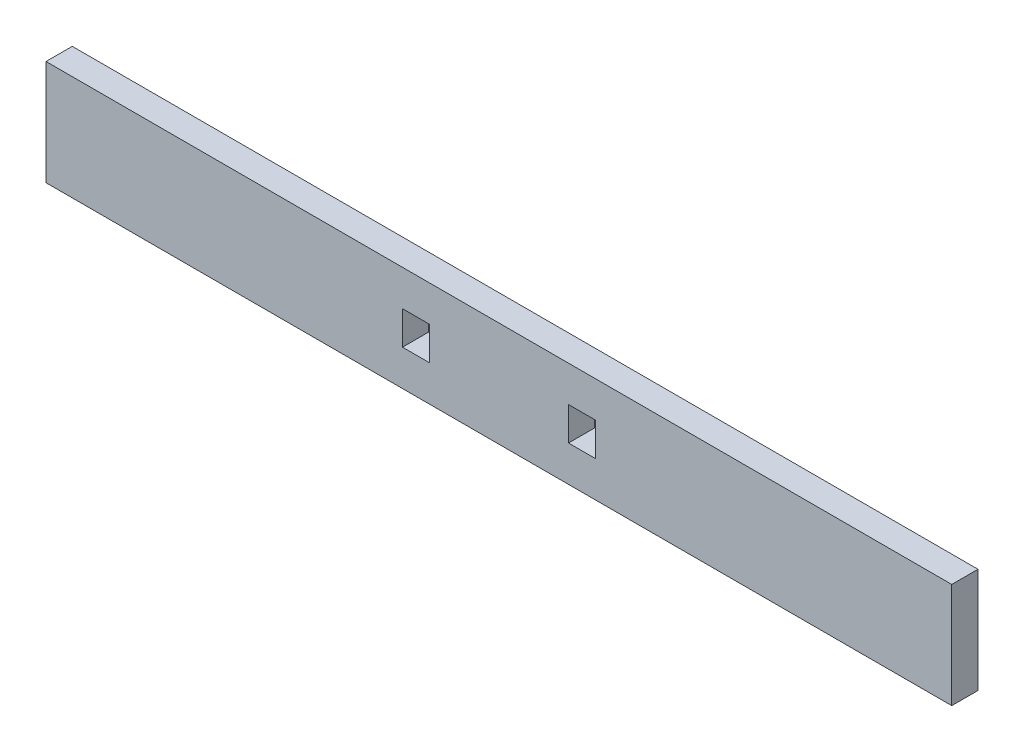
ISO-10303-21;
HEADER;
FILE_DESCRIPTION(('STEP AP214'),'2;1');
FILE_NAME('part.step','',(''),(''),'','','');
FILE_SCHEMA(('AUTOMOTIVE_DESIGN { 1 0 10303 214 1 1 1 1 }'));
ENDSEC;
DATA;
#1=APPLICATION_CONTEXT('core data for automotive mechanical design processes');
#2=APPLICATION_PROTOCOL_DEFINITION('international standard','automotive_design',2000,#1);
#3=PRODUCT_CONTEXT('',#1,'mechanical');
#4=PRODUCT('Part','Part','',(#3));
#5=PRODUCT_RELATED_PRODUCT_CATEGORY('part','',(#4));
#6=PRODUCT_DEFINITION_FORMATION('','',#4);
#7=PRODUCT_DEFINITION_CONTEXT('part definition',#1,'design');
#8=PRODUCT_DEFINITION('design','',#6,#7);
#9=PRODUCT_DEFINITION_SHAPE('','',#8);
#10=(LENGTH_UNIT() NAMED_UNIT(*) SI_UNIT(.MILLI.,.METRE.));
#11=(NAMED_UNIT(*) PLANE_ANGLE_UNIT() SI_UNIT($,.RADIAN.));
#12=(NAMED_UNIT(*) SI_UNIT($,.STERADIAN.) SOLID_ANGLE_UNIT());
#13=UNCERTAINTY_MEASURE_WITH_UNIT(LENGTH_MEASURE(1.E-05),#10,'distance_accuracy_value','');
#14=(GEOMETRIC_REPRESENTATION_CONTEXT(3) GLOBAL_UNCERTAINTY_ASSIGNED_CONTEXT((#13)) GLOBAL_UNIT_ASSIGNED_CONTEXT((#10,
#11,#12)) REPRESENTATION_CONTEXT('',''));
#15=CARTESIAN_POINT('',(0.,0.,0.));
#16=DIRECTION('',(0.,0.,1.));
#17=DIRECTION('',(1.,0.,0.));
#18=AXIS2_PLACEMENT_3D('',#15,#16,#17);
#19=CARTESIAN_POINT('',(-33.672999964,-15.0495,-19.05));
#20=DIRECTION('',(1.,0.,0.));
#21=DIRECTION('',(0.,0.,-1.));
#22=AXIS2_PLACEMENT_3D('',#19,#20,#21);
#23=PLANE('',#22);
#24=DIRECTION('',(0.,1.,0.));
#25=VECTOR('',#24,1.);
#26=CARTESIAN_POINT('',(-33.672999964,-15.0495,-31.75));
#27=LINE('',#26,#25);
#28=CARTESIAN_POINT('',(-33.672999964,-15.0495,-31.75));
#29=VERTEX_POINT('',#28);
#30=CARTESIAN_POINT('',(-33.672999964,1.0795,-31.75));
#31=VERTEX_POINT('',#30);
#32=EDGE_CURVE('E209',#29,#31,#27,.T.);
#33=ORIENTED_EDGE('',*,*,#32,.F.);
#34=DIRECTION('',(0.,0.,-1.));
#35=VECTOR('',#34,1.);
#36=CARTESIAN_POINT('',(-33.672999964,-15.0495,-19.05));
#37=LINE('',#36,#35);
#38=CARTESIAN_POINT('',(-33.672999964,-15.0495,-19.05));
#39=VERTEX_POINT('',#38);
#40=EDGE_CURVE('E179',#39,#29,#37,.T.);
#41=ORIENTED_EDGE('',*,*,#40,.F.);
#42=DIRECTION('',(0.,1.,0.));
#43=VECTOR('',#42,1.);
#44=CARTESIAN_POINT('',(-33.672999964,-15.0495,-19.05));
#45=LINE('',#44,#43);
#46=CARTESIAN_POINT('',(-33.672999964,1.0795,-19.05));
#47=VERTEX_POINT('',#46);
#48=EDGE_CURVE('E235',#39,#47,#45,.T.);
#49=ORIENTED_EDGE('',*,*,#48,.T.);
#50=DIRECTION('',(0.,0.,-1.));
#51=VECTOR('',#50,1.);
#52=CARTESIAN_POINT('',(-33.672999964,1.0795,-19.05));
#53=LINE('',#52,#51);
#54=EDGE_CURVE('E11',#47,#31,#53,.T.);
#55=ORIENTED_EDGE('',*,*,#54,.T.);
#56=EDGE_LOOP('',(#33,#41,#49,#55));
#57=FACE_BOUND('',#56,.T.);
#58=ADVANCED_FACE('F16',(#57),#23,.F.);
#59=CARTESIAN_POINT('',(-33.672999964,1.0795,-19.05));
#60=DIRECTION('',(0.,1.,0.));
#61=DIRECTION('',(1.,0.,0.));
#62=AXIS2_PLACEMENT_3D('',#59,#60,#61);
#63=PLANE('',#62);
#64=DIRECTION('',(-1.,0.,0.));
#65=VECTOR('',#64,1.);
#66=CARTESIAN_POINT('',(-33.672999964,1.0795,-31.75));
#67=LINE('',#66,#65);
#68=CARTESIAN_POINT('',(-46.626999964,1.0795,-31.75));
#69=VERTEX_POINT('',#68);
#70=EDGE_CURVE('E213',#31,#69,#67,.T.);
#71=ORIENTED_EDGE('',*,*,#70,.F.);
#72=ORIENTED_EDGE('',*,*,#54,.F.);
#73=DIRECTION('',(-1.,0.,0.));
#74=VECTOR('',#73,1.);
#75=CARTESIAN_POINT('',(-33.672999964,1.0795,-19.05));
#76=LINE('',#75,#74);
#77=CARTESIAN_POINT('',(-46.626999964,1.0795,-19.05));
#78=VERTEX_POINT('',#77);
#79=EDGE_CURVE('E20',#47,#78,#76,.T.);
#80=ORIENTED_EDGE('',*,*,#79,.T.);
#81=DIRECTION('',(0.,0.,-1.));
#82=VECTOR('',#81,1.);
#83=CARTESIAN_POINT('',(-46.626999964,1.0795,-19.05));
#84=LINE('',#83,#82);
#85=EDGE_CURVE('E27',#78,#69,#84,.T.);
#86=ORIENTED_EDGE('',*,*,#85,.T.);
#87=EDGE_LOOP('',(#71,#72,#80,#86));
#88=FACE_BOUND('',#87,.T.);
#89=ADVANCED_FACE('F305',(#88),#63,.F.);
#90=CARTESIAN_POINT('',(-46.626999964,1.0795,-19.05));
#91=DIRECTION('',(-1.,0.,0.));
#92=DIRECTION('',(0.,1.,0.));
#93=AXIS2_PLACEMENT_3D('',#90,#91,#92);
#94=PLANE('',#93);
#95=DIRECTION('',(0.,-1.,0.));
#96=VECTOR('',#95,1.);
#97=CARTESIAN_POINT('',(-46.626999964,1.0795,-31.75));
#98=LINE('',#97,#96);
#99=CARTESIAN_POINT('',(-46.626999964,-15.0495,-31.75));
#100=VERTEX_POINT('',#99);
#101=EDGE_CURVE('E217',#69,#100,#98,.T.);
#102=ORIENTED_EDGE('',*,*,#101,.F.);
#103=ORIENTED_EDGE('',*,*,#85,.F.);
#104=DIRECTION('',(0.,-1.,0.));
#105=VECTOR('',#104,1.);
#106=CARTESIAN_POINT('',(-46.626999964,1.0795,-19.05));
#107=LINE('',#106,#105);
#108=CARTESIAN_POINT('',(-46.626999964,-15.0495,-19.05));
#109=VERTEX_POINT('',#108);
#110=EDGE_CURVE('E203',#78,#109,#107,.T.);
#111=ORIENTED_EDGE('',*,*,#110,.T.);
#112=DIRECTION('',(0.,0.,-1.));
#113=VECTOR('',#112,1.);
#114=CARTESIAN_POINT('',(-46.626999964,-15.0495,-19.05));
#115=LINE('',#114,#113);
#116=EDGE_CURVE('E176',#109,#100,#115,.T.);
#117=ORIENTED_EDGE('',*,*,#116,.T.);
#118=EDGE_LOOP('',(#102,#103,#111,#117));
#119=FACE_BOUND('',#118,.T.);
#120=ADVANCED_FACE('F311',(#119),#94,.F.);
#121=CARTESIAN_POINT('',(-46.626999964,-15.0495,-19.05));
#122=DIRECTION('',(0.,-1.,0.));
#123=DIRECTION('',(-1.,0.,0.));
#124=AXIS2_PLACEMENT_3D('',#121,#122,#123);
#125=PLANE('',#124);
#126=DIRECTION('',(1.,0.,0.));
#127=VECTOR('',#126,1.);
#128=CARTESIAN_POINT('',(-46.626999964,-15.0495,-31.75));
#129=LINE('',#128,#127);
#130=EDGE_CURVE('E170',#100,#29,#129,.T.);
#131=ORIENTED_EDGE('',*,*,#130,.F.);
#132=ORIENTED_EDGE('',*,*,#116,.F.);
#133=DIRECTION('',(1.,0.,0.));
#134=VECTOR('',#133,1.);
#135=CARTESIAN_POINT('',(-46.626999964,-15.0495,-19.05));
#136=LINE('',#135,#134);
#137=EDGE_CURVE('E222',#109,#39,#136,.T.);
#138=ORIENTED_EDGE('',*,*,#137,.T.);
#139=ORIENTED_EDGE('',*,*,#40,.T.);
#140=EDGE_LOOP('',(#131,#132,#138,#139));
#141=FACE_BOUND('',#140,.T.);
#142=ADVANCED_FACE('F317',(#141),#125,.F.);
#143=CARTESIAN_POINT('',(-219.075,18.415,-19.05));
#144=DIRECTION('',(-1.,0.,0.));
#145=DIRECTION('',(0.,1.,0.));
#146=AXIS2_PLACEMENT_3D('',#143,#144,#145);
#147=PLANE('',#146);
#148=DIRECTION('',(0.,-1.,0.));
#149=VECTOR('',#148,1.);
#150=CARTESIAN_POINT('',(-219.075,18.415,-31.75));
#151=LINE('',#150,#149);
#152=CARTESIAN_POINT('',(-219.075,18.415,-31.75));
#153=VERTEX_POINT('',#152);
#154=CARTESIAN_POINT('',(-219.075,-32.385,-31.75));
#155=VERTEX_POINT('',#154);
#156=EDGE_CURVE('E200',#153,#155,#151,.T.);
#157=ORIENTED_EDGE('',*,*,#156,.T.);
#158=DIRECTION('',(0.,0.,-1.));
#159=VECTOR('',#158,1.);
#160=CARTESIAN_POINT('',(-219.075,-32.385,-19.05));
#161=LINE('',#160,#159);
#162=CARTESIAN_POINT('',(-219.075,-32.385,-19.05));
#163=VERTEX_POINT('',#162);
#164=EDGE_CURVE('E164',#163,#155,#161,.T.);
#165=ORIENTED_EDGE('',*,*,#164,.F.);
#166=DIRECTION('',(0.,-1.,0.));
#167=VECTOR('',#166,1.);
#168=CARTESIAN_POINT('',(-219.075,18.415,-19.05));
#169=LINE('',#168,#167);
#170=CARTESIAN_POINT('',(-219.075,18.415,-19.05));
#171=VERTEX_POINT('',#170);
#172=EDGE_CURVE('E159',#171,#163,#169,.T.);
#173=ORIENTED_EDGE('',*,*,#172,.F.);
#174=DIRECTION('',(0.,0.,-1.));
#175=VECTOR('',#174,1.);
#176=CARTESIAN_POINT('',(-219.075,18.415,-19.05));
#177=LINE('',#176,#175);
#178=EDGE_CURVE('E207',#171,#153,#177,.T.);
#179=ORIENTED_EDGE('',*,*,#178,.T.);
#180=EDGE_LOOP('',(#157,#165,#173,#179));
#181=FACE_BOUND('',#180,.T.);
#182=ADVANCED_FACE('F289',(#181),#147,.T.);
#183=CARTESIAN_POINT('',(33.672999964,-15.0495,-19.05));
#184=DIRECTION('',(-1.,0.,0.));
#185=DIRECTION('',(0.,0.,1.));
#186=AXIS2_PLACEMENT_3D('',#183,#184,#185);
#187=PLANE('',#186);
#188=DIRECTION('',(0.,1.,0.));
#189=VECTOR('',#188,1.);
#190=CARTESIAN_POINT('',(33.672999964,-15.0495,-31.75));
#191=LINE('',#190,#189);
#192=CARTESIAN_POINT('',(33.672999964,-15.0495,-31.75));
#193=VERTEX_POINT('',#192);
#194=CARTESIAN_POINT('',(33.672999964,1.0795,-31.75));
#195=VERTEX_POINT('',#194);
#196=EDGE_CURVE('E167',#193,#195,#191,.T.);
#197=ORIENTED_EDGE('',*,*,#196,.T.);
#198=DIRECTION('',(0.,0.,-1.));
#199=VECTOR('',#198,1.);
#200=CARTESIAN_POINT('',(33.672999964,1.0795,-19.05));
#201=LINE('',#200,#199);
#202=CARTESIAN_POINT('',(33.672999964,1.0795,-19.05));
#203=VERTEX_POINT('',#202);
#204=EDGE_CURVE('E180',#203,#195,#201,.T.);
#205=ORIENTED_EDGE('',*,*,#204,.F.);
#206=DIRECTION('',(0.,1.,0.));
#207=VECTOR('',#206,1.);
#208=CARTESIAN_POINT('',(33.672999964,-15.0495,-19.05));
#209=LINE('',#208,#207);
#210=CARTESIAN_POINT('',(33.672999964,-15.0495,-19.05));
#211=VERTEX_POINT('',#210);
#212=EDGE_CURVE('E151',#211,#203,#209,.T.);
#213=ORIENTED_EDGE('',*,*,#212,.F.);
#214=DIRECTION('',(0.,0.,-1.));
#215=VECTOR('',#214,1.);
#216=CARTESIAN_POINT('',(33.672999964,-15.0495,-19.05));
#217=LINE('',#216,#215);
#218=EDGE_CURVE('E142',#211,#193,#217,.T.);
#219=ORIENTED_EDGE('',*,*,#218,.T.);
#220=EDGE_LOOP('',(#197,#205,#213,#219));
#221=FACE_BOUND('',#220,.T.);
#222=ADVANCED_FACE('F400',(#221),#187,.F.);
#223=CARTESIAN_POINT('',(33.672999964,1.0795,-19.05));
#224=DIRECTION('',(0.,1.,0.));
#225=DIRECTION('',(1.,0.,0.));
#226=AXIS2_PLACEMENT_3D('',#223,#224,#225);
#227=PLANE('',#226);
#228=DIRECTION('',(1.,0.,0.));
#229=VECTOR('',#228,1.);
#230=CARTESIAN_POINT('',(33.672999964,1.0795,-31.75));
#231=LINE('',#230,#229);
#232=CARTESIAN_POINT('',(46.626999964,1.07949999999999,-31.75));
#233=VERTEX_POINT('',#232);
#234=EDGE_CURVE('E171',#195,#233,#231,.T.);
#235=ORIENTED_EDGE('',*,*,#234,.T.);
#236=DIRECTION('',(0.,0.,-1.));
#237=VECTOR('',#236,1.);
#238=CARTESIAN_POINT('',(46.626999964,1.07949999999999,-19.05));
#239=LINE('',#238,#237);
#240=CARTESIAN_POINT('',(46.626999964,1.07949999999999,-19.05));
#241=VERTEX_POINT('',#240);
#242=EDGE_CURVE('E141',#241,#233,#239,.T.);
#243=ORIENTED_EDGE('',*,*,#242,.F.);
#244=DIRECTION('',(1.,0.,0.));
#245=VECTOR('',#244,1.);
#246=CARTESIAN_POINT('',(33.672999964,1.0795,-19.05));
#247=LINE('',#246,#245);
#248=EDGE_CURVE('E157',#203,#241,#247,.T.);
#249=ORIENTED_EDGE('',*,*,#248,.F.);
#250=ORIENTED_EDGE('',*,*,#204,.T.);
#251=EDGE_LOOP('',(#235,#243,#249,#250));
#252=FACE_BOUND('',#251,.T.);
#253=ADVANCED_FACE('F404',(#252),#227,.F.);
#254=CARTESIAN_POINT('',(46.626999964,1.07949999999999,-19.05));
#255=DIRECTION('',(1.,0.,0.));
#256=DIRECTION('',(0.,1.,0.));
#257=AXIS2_PLACEMENT_3D('',#254,#255,#256);
#258=PLANE('',#257);
#259=DIRECTION('',(0.,-1.,0.));
#260=VECTOR('',#259,1.);
#261=CARTESIAN_POINT('',(46.626999964,1.07949999999999,-31.75));
#262=LINE('',#261,#260);
#263=CARTESIAN_POINT('',(46.626999964,-15.0495,-31.75));
#264=VERTEX_POINT('',#263);
#265=EDGE_CURVE('E136',#233,#264,#262,.T.);
#266=ORIENTED_EDGE('',*,*,#265,.T.);
#267=DIRECTION('',(0.,0.,-1.));
#268=VECTOR('',#267,1.);
#269=CARTESIAN_POINT('',(46.626999964,-15.0495,-19.05));
#270=LINE('',#269,#268);
#271=CARTESIAN_POINT('',(46.626999964,-15.0495,-19.05));
#272=VERTEX_POINT('',#271);
#273=EDGE_CURVE('E130',#272,#264,#270,.T.);
#274=ORIENTED_EDGE('',*,*,#273,.F.);
#275=DIRECTION('',(0.,-1.,0.));
#276=VECTOR('',#275,1.);
#277=CARTESIAN_POINT('',(46.626999964,1.07949999999999,-19.05));
#278=LINE('',#277,#276);
#279=EDGE_CURVE('E134',#241,#272,#278,.T.);
#280=ORIENTED_EDGE('',*,*,#279,.F.);
#281=ORIENTED_EDGE('',*,*,#242,.T.);
#282=EDGE_LOOP('',(#266,#274,#280,#281));
#283=FACE_BOUND('',#282,.T.);
#284=ADVANCED_FACE('F132',(#283),#258,.F.);
#285=CARTESIAN_POINT('',(46.626999964,-15.0495,-19.05));
#286=DIRECTION('',(0.,-1.,0.));
#287=DIRECTION('',(0.,0.,-1.));
#288=AXIS2_PLACEMENT_3D('',#285,#286,#287);
#289=PLANE('',#288);
#290=DIRECTION('',(-1.,0.,0.));
#291=VECTOR('',#290,1.);
#292=CARTESIAN_POINT('',(46.626999964,-15.0495,-31.75));
#293=LINE('',#292,#291);
#294=EDGE_CURVE('E175',#264,#193,#293,.T.);
#295=ORIENTED_EDGE('',*,*,#294,.T.);
#296=ORIENTED_EDGE('',*,*,#218,.F.);
#297=DIRECTION('',(-1.,0.,0.));
#298=VECTOR('',#297,1.);
#299=CARTESIAN_POINT('',(46.626999964,-15.0495,-19.05));
#300=LINE('',#299,#298);
#301=EDGE_CURVE('E145',#272,#211,#300,.T.);
#302=ORIENTED_EDGE('',*,*,#301,.F.);
#303=ORIENTED_EDGE('',*,*,#273,.T.);
#304=EDGE_LOOP('',(#295,#296,#302,#303));
#305=FACE_BOUND('',#304,.T.);
#306=ADVANCED_FACE('F18',(#305),#289,.F.);
#307=CARTESIAN_POINT('',(0.,0.,-31.75));
#308=DIRECTION('',(0.,0.,-1.));
#309=DIRECTION('',(0.,-1.,0.));
#310=AXIS2_PLACEMENT_3D('',#307,#308,#309);
#311=PLANE('',#310);
#312=ORIENTED_EDGE('',*,*,#130,.T.);
#313=ORIENTED_EDGE('',*,*,#32,.T.);
#314=ORIENTED_EDGE('',*,*,#70,.T.);
#315=ORIENTED_EDGE('',*,*,#101,.T.);
#316=EDGE_LOOP('',(#312,#313,#314,#315));
#317=FACE_BOUND('',#316,.T.);
#318=ORIENTED_EDGE('',*,*,#294,.F.);
#319=ORIENTED_EDGE('',*,*,#265,.F.);
#320=ORIENTED_EDGE('',*,*,#234,.F.);
#321=ORIENTED_EDGE('',*,*,#196,.F.);
#322=EDGE_LOOP('',(#318,#319,#320,#321));
#323=FACE_BOUND('',#322,.T.);
#324=DIRECTION('',(0.,-1.,0.));
#325=VECTOR('',#324,1.);
#326=CARTESIAN_POINT('',(219.075,18.415,-31.75));
#327=LINE('',#326,#325);
#328=CARTESIAN_POINT('',(219.075,18.415,-31.75));
#329=VERTEX_POINT('',#328);
#330=CARTESIAN_POINT('',(219.075,-32.385,-31.75));
#331=VERTEX_POINT('',#330);
#332=EDGE_CURVE('E189',#329,#331,#327,.T.);
#333=ORIENTED_EDGE('',*,*,#332,.T.);
#334=DIRECTION('',(-1.,0.,0.));
#335=VECTOR('',#334,1.);
#336=CARTESIAN_POINT('',(219.075,-32.385,-31.75));
#337=LINE('',#336,#335);
#338=EDGE_CURVE('E185',#331,#155,#337,.T.);
#339=ORIENTED_EDGE('',*,*,#338,.T.);
#340=ORIENTED_EDGE('',*,*,#156,.F.);
#341=DIRECTION('',(1.,0.,0.));
#342=VECTOR('',#341,1.);
#343=CARTESIAN_POINT('',(219.075,18.415,-31.75));
#344=LINE('',#343,#342);
#345=EDGE_CURVE('E204',#153,#329,#344,.T.);
#346=ORIENTED_EDGE('',*,*,#345,.T.);
#347=EDGE_LOOP('',(#333,#339,#340,#346));
#348=FACE_BOUND('',#347,.T.);
#349=ADVANCED_FACE('F280',(#317,#323,#348),#311,.T.);
#350=CARTESIAN_POINT('',(0.,0.,-19.05));
#351=DIRECTION('',(0.,0.,-1.));
#352=DIRECTION('',(0.,-1.,0.));
#353=AXIS2_PLACEMENT_3D('',#350,#351,#352);
#354=PLANE('',#353);
#355=ORIENTED_EDGE('',*,*,#110,.F.);
#356=ORIENTED_EDGE('',*,*,#79,.F.);
#357=ORIENTED_EDGE('',*,*,#48,.F.);
#358=ORIENTED_EDGE('',*,*,#137,.F.);
#359=EDGE_LOOP('',(#355,#356,#357,#358));
#360=FACE_BOUND('',#359,.T.);
#361=ORIENTED_EDGE('',*,*,#279,.T.);
#362=ORIENTED_EDGE('',*,*,#301,.T.);
#363=ORIENTED_EDGE('',*,*,#212,.T.);
#364=ORIENTED_EDGE('',*,*,#248,.T.);
#365=EDGE_LOOP('',(#361,#362,#363,#364));
#366=FACE_BOUND('',#365,.T.);
#367=DIRECTION('',(0.,-1.,0.));
#368=VECTOR('',#367,1.);
#369=CARTESIAN_POINT('',(219.075,18.415,-19.05));
#370=LINE('',#369,#368);
#371=CARTESIAN_POINT('',(219.075,18.415,-19.05));
#372=VERTEX_POINT('',#371);
#373=CARTESIAN_POINT('',(219.075,-32.385,-19.05));
#374=VERTEX_POINT('',#373);
#375=EDGE_CURVE('E241',#372,#374,#370,.T.);
#376=ORIENTED_EDGE('',*,*,#375,.F.);
#377=DIRECTION('',(1.,0.,0.));
#378=VECTOR('',#377,1.);
#379=CARTESIAN_POINT('',(219.075,18.415,-19.05));
#380=LINE('',#379,#378);
#381=EDGE_CURVE('E223',#171,#372,#380,.T.);
#382=ORIENTED_EDGE('',*,*,#381,.F.);
#383=ORIENTED_EDGE('',*,*,#172,.T.);
#384=DIRECTION('',(-1.,0.,0.));
#385=VECTOR('',#384,1.);
#386=CARTESIAN_POINT('',(219.075,-32.385,-19.05));
#387=LINE('',#386,#385);
#388=EDGE_CURVE('E181',#374,#163,#387,.T.);
#389=ORIENTED_EDGE('',*,*,#388,.F.);
#390=EDGE_LOOP('',(#376,#382,#383,#389));
#391=FACE_BOUND('',#390,.T.);
#392=ADVANCED_FACE('F154',(#360,#366,#391),#354,.F.);
#393=CARTESIAN_POINT('',(219.075,-32.385,-19.05));
#394=DIRECTION('',(0.,-1.,0.));
#395=DIRECTION('',(0.,0.,-1.));
#396=AXIS2_PLACEMENT_3D('',#393,#394,#395);
#397=PLANE('',#396);
#398=ORIENTED_EDGE('',*,*,#338,.F.);
#399=DIRECTION('',(0.,0.,-1.));
#400=VECTOR('',#399,1.);
#401=CARTESIAN_POINT('',(219.075,-32.385,-19.05));
#402=LINE('',#401,#400);
#403=EDGE_CURVE('E208',#374,#331,#402,.T.);
#404=ORIENTED_EDGE('',*,*,#403,.F.);
#405=ORIENTED_EDGE('',*,*,#388,.T.);
#406=ORIENTED_EDGE('',*,*,#164,.T.);
#407=EDGE_LOOP('',(#398,#404,#405,#406));
#408=FACE_BOUND('',#407,.T.);
#409=ADVANCED_FACE('F286',(#408),#397,.T.);
#410=CARTESIAN_POINT('',(219.075,18.415,-19.05));
#411=DIRECTION('',(0.,1.,0.));
#412=DIRECTION('',(1.,0.,0.));
#413=AXIS2_PLACEMENT_3D('',#410,#411,#412);
#414=PLANE('',#413);
#415=ORIENTED_EDGE('',*,*,#345,.F.);
#416=ORIENTED_EDGE('',*,*,#178,.F.);
#417=ORIENTED_EDGE('',*,*,#381,.T.);
#418=DIRECTION('',(0.,0.,-1.));
#419=VECTOR('',#418,1.);
#420=CARTESIAN_POINT('',(219.075,18.415,-19.05));
#421=LINE('',#420,#419);
#422=EDGE_CURVE('E193',#372,#329,#421,.T.);
#423=ORIENTED_EDGE('',*,*,#422,.T.);
#424=EDGE_LOOP('',(#415,#416,#417,#423));
#425=FACE_BOUND('',#424,.T.);
#426=ADVANCED_FACE('F272',(#425),#414,.T.);
#427=CARTESIAN_POINT('',(219.075,18.415,-19.05));
#428=DIRECTION('',(1.,0.,0.));
#429=DIRECTION('',(0.,1.,0.));
#430=AXIS2_PLACEMENT_3D('',#427,#428,#429);
#431=PLANE('',#430);
#432=ORIENTED_EDGE('',*,*,#332,.F.);
#433=ORIENTED_EDGE('',*,*,#422,.F.);
#434=ORIENTED_EDGE('',*,*,#375,.T.);
#435=ORIENTED_EDGE('',*,*,#403,.T.);
#436=EDGE_LOOP('',(#432,#433,#434,#435));
#437=FACE_BOUND('',#436,.T.);
#438=ADVANCED_FACE('F277',(#437),#431,.T.);
#439=CLOSED_SHELL('',(#58,#89,#120,#142,#182,#222,#253,#284,#306,#349,#392,#409,#426,#438));
#440=MANIFOLD_SOLID_BREP('B1',#439);
#441=ADVANCED_BREP_SHAPE_REPRESENTATION('',(#18,#440),#14);
#442=SHAPE_DEFINITION_REPRESENTATION(#9,#441);
ENDSEC;
END-ISO-10303-21;
